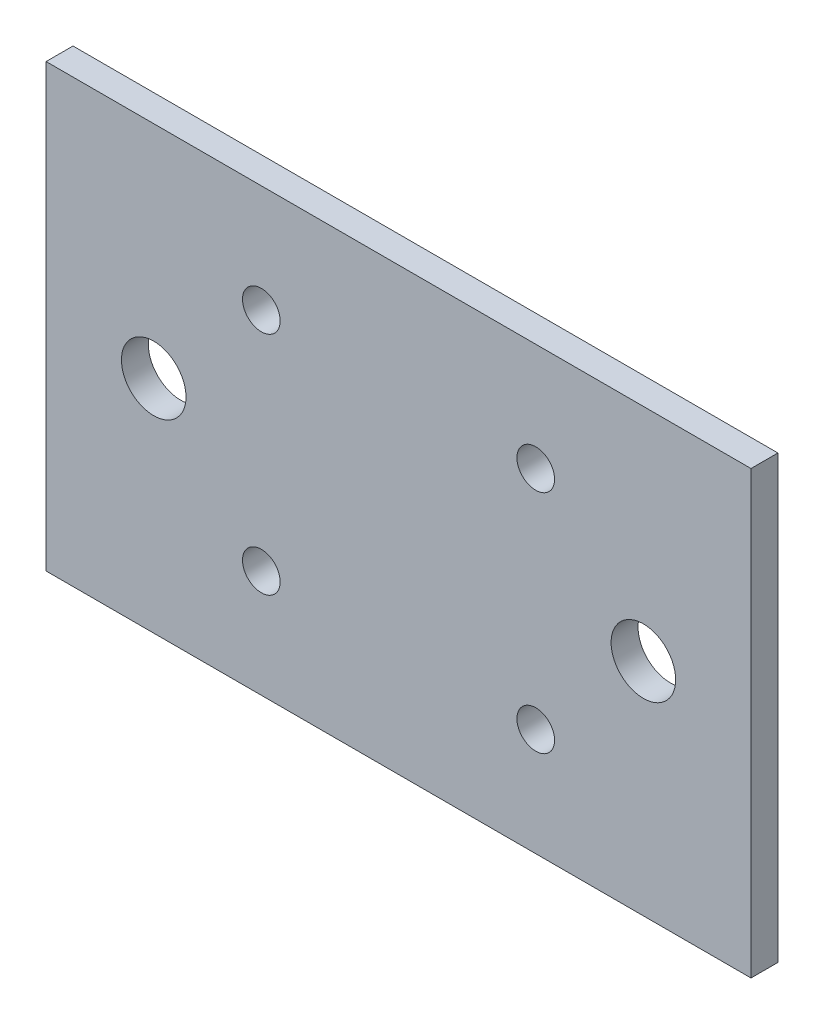
ISO-10303-21;
HEADER;
FILE_DESCRIPTION(('STEP AP214'),'2;1');
FILE_NAME('part.step','',(''),(''),'','','');
FILE_SCHEMA(('AUTOMOTIVE_DESIGN { 1 0 10303 214 1 1 1 1 }'));
ENDSEC;
DATA;
#1=APPLICATION_CONTEXT('core data for automotive mechanical design processes');
#2=APPLICATION_PROTOCOL_DEFINITION('international standard','automotive_design',2000,#1);
#3=PRODUCT_CONTEXT('',#1,'mechanical');
#4=PRODUCT('Part','Part','',(#3));
#5=PRODUCT_RELATED_PRODUCT_CATEGORY('part','',(#4));
#6=PRODUCT_DEFINITION_FORMATION('','',#4);
#7=PRODUCT_DEFINITION_CONTEXT('part definition',#1,'design');
#8=PRODUCT_DEFINITION('design','',#6,#7);
#9=PRODUCT_DEFINITION_SHAPE('','',#8);
#10=(LENGTH_UNIT() NAMED_UNIT(*) SI_UNIT(.MILLI.,.METRE.));
#11=(NAMED_UNIT(*) PLANE_ANGLE_UNIT() SI_UNIT($,.RADIAN.));
#12=(NAMED_UNIT(*) SI_UNIT($,.STERADIAN.) SOLID_ANGLE_UNIT());
#13=UNCERTAINTY_MEASURE_WITH_UNIT(LENGTH_MEASURE(1.E-05),#10,'distance_accuracy_value','');
#14=(GEOMETRIC_REPRESENTATION_CONTEXT(3) GLOBAL_UNCERTAINTY_ASSIGNED_CONTEXT((#13)) GLOBAL_UNIT_ASSIGNED_CONTEXT((#10,
#11,#12)) REPRESENTATION_CONTEXT('',''));
#15=CARTESIAN_POINT('',(0.,0.,0.));
#16=DIRECTION('',(0.,0.,1.));
#17=DIRECTION('',(1.,0.,0.));
#18=AXIS2_PLACEMENT_3D('',#15,#16,#17);
#19=CARTESIAN_POINT('',(0.,0.,2.5));
#20=DIRECTION('',(0.,0.,1.));
#21=DIRECTION('',(1.,0.,0.));
#22=AXIS2_PLACEMENT_3D('',#19,#20,#21);
#23=PLANE('',#22);
#24=CARTESIAN_POINT('',(12.75,-10.5,2.5));
#25=DIRECTION('',(0.,0.,1.));
#26=DIRECTION('',(1.,0.,0.));
#27=AXIS2_PLACEMENT_3D('',#24,#25,#26);
#28=CIRCLE('',#27,1.75);
#29=CARTESIAN_POINT('',(14.5,-10.5,2.5));
#30=VERTEX_POINT('',#29);
#31=EDGE_CURVE('E133',#30,#30,#28,.T.);
#32=ORIENTED_EDGE('',*,*,#31,.F.);
#33=EDGE_LOOP('',(#32));
#34=FACE_BOUND('',#33,.T.);
#35=CARTESIAN_POINT('',(-12.75,10.5,2.5));
#36=DIRECTION('',(0.,0.,1.));
#37=DIRECTION('',(1.,0.,0.));
#38=AXIS2_PLACEMENT_3D('',#35,#36,#37);
#39=CIRCLE('',#38,1.75);
#40=CARTESIAN_POINT('',(-11.,10.5,2.5));
#41=VERTEX_POINT('',#40);
#42=EDGE_CURVE('E121',#41,#41,#39,.T.);
#43=ORIENTED_EDGE('',*,*,#42,.F.);
#44=EDGE_LOOP('',(#43));
#45=FACE_BOUND('',#44,.T.);
#46=CARTESIAN_POINT('',(-22.75,0.,2.5));
#47=DIRECTION('',(0.,0.,1.));
#48=DIRECTION('',(1.,0.,0.));
#49=AXIS2_PLACEMENT_3D('',#46,#47,#48);
#50=CIRCLE('',#49,3.00000000000001);
#51=CARTESIAN_POINT('',(-19.75,0.,2.5));
#52=VERTEX_POINT('',#51);
#53=EDGE_CURVE('E100',#52,#52,#50,.T.);
#54=ORIENTED_EDGE('',*,*,#53,.F.);
#55=EDGE_LOOP('',(#54));
#56=FACE_BOUND('',#55,.T.);
#57=DIRECTION('',(0.,1.,0.));
#58=VECTOR('',#57,1.);
#59=CARTESIAN_POINT('',(32.75,20.5,2.5));
#60=LINE('',#59,#58);
#61=CARTESIAN_POINT('',(32.75,-20.5,2.5));
#62=VERTEX_POINT('',#61);
#63=CARTESIAN_POINT('',(32.75,20.5,2.5));
#64=VERTEX_POINT('',#63);
#65=EDGE_CURVE('E85',#62,#64,#60,.T.);
#66=ORIENTED_EDGE('',*,*,#65,.T.);
#67=DIRECTION('',(-1.,0.,0.));
#68=VECTOR('',#67,1.);
#69=CARTESIAN_POINT('',(-32.75,20.5,2.5));
#70=LINE('',#69,#68);
#71=CARTESIAN_POINT('',(-32.75,20.5,2.5));
#72=VERTEX_POINT('',#71);
#73=EDGE_CURVE('E80',#64,#72,#70,.T.);
#74=ORIENTED_EDGE('',*,*,#73,.T.);
#75=DIRECTION('',(0.,-1.,0.));
#76=VECTOR('',#75,1.);
#77=CARTESIAN_POINT('',(-32.75,20.5,2.5));
#78=LINE('',#77,#76);
#79=CARTESIAN_POINT('',(-32.75,-20.5,2.5));
#80=VERTEX_POINT('',#79);
#81=EDGE_CURVE('E83',#72,#80,#78,.T.);
#82=ORIENTED_EDGE('',*,*,#81,.T.);
#83=DIRECTION('',(1.,0.,0.));
#84=VECTOR('',#83,1.);
#85=CARTESIAN_POINT('',(-32.75,-20.5,2.5));
#86=LINE('',#85,#84);
#87=EDGE_CURVE('E50',#80,#62,#86,.T.);
#88=ORIENTED_EDGE('',*,*,#87,.T.);
#89=EDGE_LOOP('',(#66,#74,#82,#88));
#90=FACE_BOUND('',#89,.T.);
#91=CARTESIAN_POINT('',(22.75,0.,2.5));
#92=DIRECTION('',(0.,0.,1.));
#93=DIRECTION('',(1.,0.,0.));
#94=AXIS2_PLACEMENT_3D('',#91,#92,#93);
#95=CIRCLE('',#94,3.00000000000001);
#96=CARTESIAN_POINT('',(25.75,0.,2.5));
#97=VERTEX_POINT('',#96);
#98=EDGE_CURVE('E115',#97,#97,#95,.T.);
#99=ORIENTED_EDGE('',*,*,#98,.F.);
#100=EDGE_LOOP('',(#99));
#101=FACE_BOUND('',#100,.T.);
#102=CARTESIAN_POINT('',(12.75,10.5,2.5));
#103=DIRECTION('',(0.,0.,1.));
#104=DIRECTION('',(1.,0.,0.));
#105=AXIS2_PLACEMENT_3D('',#102,#103,#104);
#106=CIRCLE('',#105,1.75);
#107=CARTESIAN_POINT('',(14.5,10.5,2.5));
#108=VERTEX_POINT('',#107);
#109=EDGE_CURVE('E127',#108,#108,#106,.T.);
#110=ORIENTED_EDGE('',*,*,#109,.F.);
#111=EDGE_LOOP('',(#110));
#112=FACE_BOUND('',#111,.T.);
#113=CARTESIAN_POINT('',(-12.75,-10.5,2.5));
#114=DIRECTION('',(0.,0.,1.));
#115=DIRECTION('',(1.,0.,0.));
#116=AXIS2_PLACEMENT_3D('',#113,#114,#115);
#117=CIRCLE('',#116,1.75);
#118=CARTESIAN_POINT('',(-11.,-10.5,2.5));
#119=VERTEX_POINT('',#118);
#120=EDGE_CURVE('E139',#119,#119,#117,.T.);
#121=ORIENTED_EDGE('',*,*,#120,.F.);
#122=EDGE_LOOP('',(#121));
#123=FACE_BOUND('',#122,.T.);
#124=ADVANCED_FACE('F33',(#34,#45,#56,#90,#101,#112,#123),#23,.T.);
#125=CARTESIAN_POINT('',(0.,0.,0.));
#126=DIRECTION('',(0.,0.,1.));
#127=DIRECTION('',(1.,0.,0.));
#128=AXIS2_PLACEMENT_3D('',#125,#126,#127);
#129=PLANE('',#128);
#130=DIRECTION('',(0.,1.,0.));
#131=VECTOR('',#130,1.);
#132=CARTESIAN_POINT('',(32.75,20.5,0.));
#133=LINE('',#132,#131);
#134=CARTESIAN_POINT('',(32.75,-20.5,0.));
#135=VERTEX_POINT('',#134);
#136=CARTESIAN_POINT('',(32.75,20.5,0.));
#137=VERTEX_POINT('',#136);
#138=EDGE_CURVE('E97',#135,#137,#133,.T.);
#139=ORIENTED_EDGE('',*,*,#138,.F.);
#140=DIRECTION('',(1.,0.,0.));
#141=VECTOR('',#140,1.);
#142=CARTESIAN_POINT('',(-32.75,-20.5,0.));
#143=LINE('',#142,#141);
#144=CARTESIAN_POINT('',(-32.75,-20.5,0.));
#145=VERTEX_POINT('',#144);
#146=EDGE_CURVE('E73',#145,#135,#143,.T.);
#147=ORIENTED_EDGE('',*,*,#146,.F.);
#148=DIRECTION('',(0.,-1.,0.));
#149=VECTOR('',#148,1.);
#150=CARTESIAN_POINT('',(-32.75,20.5,0.));
#151=LINE('',#150,#149);
#152=CARTESIAN_POINT('',(-32.75,20.5,0.));
#153=VERTEX_POINT('',#152);
#154=EDGE_CURVE('E67',#153,#145,#151,.T.);
#155=ORIENTED_EDGE('',*,*,#154,.F.);
#156=DIRECTION('',(-1.,0.,0.));
#157=VECTOR('',#156,1.);
#158=CARTESIAN_POINT('',(-32.75,20.5,0.));
#159=LINE('',#158,#157);
#160=EDGE_CURVE('E89',#137,#153,#159,.T.);
#161=ORIENTED_EDGE('',*,*,#160,.F.);
#162=EDGE_LOOP('',(#139,#147,#155,#161));
#163=FACE_BOUND('',#162,.T.);
#164=CARTESIAN_POINT('',(-22.75,0.,0.));
#165=DIRECTION('',(0.,0.,1.));
#166=DIRECTION('',(1.,0.,0.));
#167=AXIS2_PLACEMENT_3D('',#164,#165,#166);
#168=CIRCLE('',#167,3.00000000000001);
#169=CARTESIAN_POINT('',(-19.75,0.,0.));
#170=VERTEX_POINT('',#169);
#171=EDGE_CURVE('E112',#170,#170,#168,.T.);
#172=ORIENTED_EDGE('',*,*,#171,.T.);
#173=EDGE_LOOP('',(#172));
#174=FACE_BOUND('',#173,.T.);
#175=CARTESIAN_POINT('',(22.75,0.,0.));
#176=DIRECTION('',(0.,0.,1.));
#177=DIRECTION('',(1.,0.,0.));
#178=AXIS2_PLACEMENT_3D('',#175,#176,#177);
#179=CIRCLE('',#178,3.00000000000001);
#180=CARTESIAN_POINT('',(25.75,0.,0.));
#181=VERTEX_POINT('',#180);
#182=EDGE_CURVE('E118',#181,#181,#179,.T.);
#183=ORIENTED_EDGE('',*,*,#182,.T.);
#184=EDGE_LOOP('',(#183));
#185=FACE_BOUND('',#184,.T.);
#186=CARTESIAN_POINT('',(-12.75,10.5,0.));
#187=DIRECTION('',(0.,0.,1.));
#188=DIRECTION('',(1.,0.,0.));
#189=AXIS2_PLACEMENT_3D('',#186,#187,#188);
#190=CIRCLE('',#189,1.75);
#191=CARTESIAN_POINT('',(-11.,10.5,0.));
#192=VERTEX_POINT('',#191);
#193=EDGE_CURVE('E124',#192,#192,#190,.T.);
#194=ORIENTED_EDGE('',*,*,#193,.T.);
#195=EDGE_LOOP('',(#194));
#196=FACE_BOUND('',#195,.T.);
#197=CARTESIAN_POINT('',(12.75,10.5,0.));
#198=DIRECTION('',(0.,0.,1.));
#199=DIRECTION('',(1.,0.,0.));
#200=AXIS2_PLACEMENT_3D('',#197,#198,#199);
#201=CIRCLE('',#200,1.75);
#202=CARTESIAN_POINT('',(14.5,10.5,0.));
#203=VERTEX_POINT('',#202);
#204=EDGE_CURVE('E130',#203,#203,#201,.T.);
#205=ORIENTED_EDGE('',*,*,#204,.T.);
#206=EDGE_LOOP('',(#205));
#207=FACE_BOUND('',#206,.T.);
#208=CARTESIAN_POINT('',(12.75,-10.5,0.));
#209=DIRECTION('',(0.,0.,1.));
#210=DIRECTION('',(1.,0.,0.));
#211=AXIS2_PLACEMENT_3D('',#208,#209,#210);
#212=CIRCLE('',#211,1.75);
#213=CARTESIAN_POINT('',(14.5,-10.5,0.));
#214=VERTEX_POINT('',#213);
#215=EDGE_CURVE('E136',#214,#214,#212,.T.);
#216=ORIENTED_EDGE('',*,*,#215,.T.);
#217=EDGE_LOOP('',(#216));
#218=FACE_BOUND('',#217,.T.);
#219=CARTESIAN_POINT('',(-12.75,-10.5,0.));
#220=DIRECTION('',(0.,0.,1.));
#221=DIRECTION('',(1.,0.,0.));
#222=AXIS2_PLACEMENT_3D('',#219,#220,#221);
#223=CIRCLE('',#222,1.75);
#224=CARTESIAN_POINT('',(-11.,-10.5,0.));
#225=VERTEX_POINT('',#224);
#226=EDGE_CURVE('E142',#225,#225,#223,.T.);
#227=ORIENTED_EDGE('',*,*,#226,.T.);
#228=EDGE_LOOP('',(#227));
#229=FACE_BOUND('',#228,.T.);
#230=ADVANCED_FACE('F108',(#163,#174,#185,#196,#207,#218,#229),#129,.F.);
#231=CARTESIAN_POINT('',(32.75,20.5,2.5));
#232=DIRECTION('',(-1.,0.,0.));
#233=DIRECTION('',(0.,-1.,0.));
#234=AXIS2_PLACEMENT_3D('',#231,#232,#233);
#235=PLANE('',#234);
#236=ORIENTED_EDGE('',*,*,#138,.T.);
#237=DIRECTION('',(0.,0.,-1.));
#238=VECTOR('',#237,1.);
#239=CARTESIAN_POINT('',(32.75,20.5,2.5));
#240=LINE('',#239,#238);
#241=EDGE_CURVE('E11',#64,#137,#240,.T.);
#242=ORIENTED_EDGE('',*,*,#241,.F.);
#243=ORIENTED_EDGE('',*,*,#65,.F.);
#244=DIRECTION('',(0.,0.,-1.));
#245=VECTOR('',#244,1.);
#246=CARTESIAN_POINT('',(32.75,-20.5,2.5));
#247=LINE('',#246,#245);
#248=EDGE_CURVE('E93',#62,#135,#247,.T.);
#249=ORIENTED_EDGE('',*,*,#248,.T.);
#250=EDGE_LOOP('',(#236,#242,#243,#249));
#251=FACE_BOUND('',#250,.T.);
#252=ADVANCED_FACE('F35',(#251),#235,.F.);
#253=CARTESIAN_POINT('',(-32.75,20.5,2.5));
#254=DIRECTION('',(0.,-1.,0.));
#255=DIRECTION('',(0.,0.,-1.));
#256=AXIS2_PLACEMENT_3D('',#253,#254,#255);
#257=PLANE('',#256);
#258=ORIENTED_EDGE('',*,*,#160,.T.);
#259=DIRECTION('',(0.,0.,-1.));
#260=VECTOR('',#259,1.);
#261=CARTESIAN_POINT('',(-32.75,20.5,2.5));
#262=LINE('',#261,#260);
#263=EDGE_CURVE('E42',#72,#153,#262,.T.);
#264=ORIENTED_EDGE('',*,*,#263,.F.);
#265=ORIENTED_EDGE('',*,*,#73,.F.);
#266=ORIENTED_EDGE('',*,*,#241,.T.);
#267=EDGE_LOOP('',(#258,#264,#265,#266));
#268=FACE_BOUND('',#267,.T.);
#269=ADVANCED_FACE('F88',(#268),#257,.F.);
#270=CARTESIAN_POINT('',(-32.75,20.5,2.5));
#271=DIRECTION('',(1.,0.,0.));
#272=DIRECTION('',(0.,0.,-1.));
#273=AXIS2_PLACEMENT_3D('',#270,#271,#272);
#274=PLANE('',#273);
#275=ORIENTED_EDGE('',*,*,#154,.T.);
#276=DIRECTION('',(0.,0.,-1.));
#277=VECTOR('',#276,1.);
#278=CARTESIAN_POINT('',(-32.75,-20.5,2.5));
#279=LINE('',#278,#277);
#280=EDGE_CURVE('E90',#80,#145,#279,.T.);
#281=ORIENTED_EDGE('',*,*,#280,.F.);
#282=ORIENTED_EDGE('',*,*,#81,.F.);
#283=ORIENTED_EDGE('',*,*,#263,.T.);
#284=EDGE_LOOP('',(#275,#281,#282,#283));
#285=FACE_BOUND('',#284,.T.);
#286=ADVANCED_FACE('F91',(#285),#274,.F.);
#287=CARTESIAN_POINT('',(-32.75,-20.5,2.5));
#288=DIRECTION('',(0.,1.,0.));
#289=DIRECTION('',(0.,0.,1.));
#290=AXIS2_PLACEMENT_3D('',#287,#288,#289);
#291=PLANE('',#290);
#292=ORIENTED_EDGE('',*,*,#146,.T.);
#293=ORIENTED_EDGE('',*,*,#248,.F.);
#294=ORIENTED_EDGE('',*,*,#87,.F.);
#295=ORIENTED_EDGE('',*,*,#280,.T.);
#296=EDGE_LOOP('',(#292,#293,#294,#295));
#297=FACE_BOUND('',#296,.T.);
#298=ADVANCED_FACE('F105',(#297),#291,.F.);
#299=CARTESIAN_POINT('',(-22.75,0.,2.5));
#300=DIRECTION('',(0.,0.,-1.));
#301=DIRECTION('',(-1.,0.,0.));
#302=AXIS2_PLACEMENT_3D('',#299,#300,#301);
#303=CYLINDRICAL_SURFACE('',#302,3.00000000000001);
#304=ORIENTED_EDGE('',*,*,#53,.T.);
#305=EDGE_LOOP('',(#304));
#306=FACE_BOUND('',#305,.T.);
#307=ORIENTED_EDGE('',*,*,#171,.F.);
#308=EDGE_LOOP('',(#307));
#309=FACE_BOUND('',#308,.T.);
#310=ADVANCED_FACE('F161',(#306,#309),#303,.F.);
#311=CARTESIAN_POINT('',(22.75,0.,2.5));
#312=DIRECTION('',(0.,0.,-1.));
#313=DIRECTION('',(-1.,0.,0.));
#314=AXIS2_PLACEMENT_3D('',#311,#312,#313);
#315=CYLINDRICAL_SURFACE('',#314,3.00000000000001);
#316=ORIENTED_EDGE('',*,*,#98,.T.);
#317=EDGE_LOOP('',(#316));
#318=FACE_BOUND('',#317,.T.);
#319=ORIENTED_EDGE('',*,*,#182,.F.);
#320=EDGE_LOOP('',(#319));
#321=FACE_BOUND('',#320,.T.);
#322=ADVANCED_FACE('F207',(#318,#321),#315,.F.);
#323=CARTESIAN_POINT('',(-12.75,10.5,2.5));
#324=DIRECTION('',(0.,0.,-1.));
#325=DIRECTION('',(-1.,0.,0.));
#326=AXIS2_PLACEMENT_3D('',#323,#324,#325);
#327=CYLINDRICAL_SURFACE('',#326,1.75);
#328=ORIENTED_EDGE('',*,*,#42,.T.);
#329=EDGE_LOOP('',(#328));
#330=FACE_BOUND('',#329,.T.);
#331=ORIENTED_EDGE('',*,*,#193,.F.);
#332=EDGE_LOOP('',(#331));
#333=FACE_BOUND('',#332,.T.);
#334=ADVANCED_FACE('F215',(#330,#333),#327,.F.);
#335=CARTESIAN_POINT('',(12.75,10.5,2.5));
#336=DIRECTION('',(0.,0.,-1.));
#337=DIRECTION('',(-1.,0.,0.));
#338=AXIS2_PLACEMENT_3D('',#335,#336,#337);
#339=CYLINDRICAL_SURFACE('',#338,1.75);
#340=ORIENTED_EDGE('',*,*,#109,.T.);
#341=EDGE_LOOP('',(#340));
#342=FACE_BOUND('',#341,.T.);
#343=ORIENTED_EDGE('',*,*,#204,.F.);
#344=EDGE_LOOP('',(#343));
#345=FACE_BOUND('',#344,.T.);
#346=ADVANCED_FACE('F223',(#342,#345),#339,.F.);
#347=CARTESIAN_POINT('',(12.75,-10.5,2.5));
#348=DIRECTION('',(0.,0.,-1.));
#349=DIRECTION('',(-1.,0.,0.));
#350=AXIS2_PLACEMENT_3D('',#347,#348,#349);
#351=CYLINDRICAL_SURFACE('',#350,1.75);
#352=ORIENTED_EDGE('',*,*,#31,.T.);
#353=EDGE_LOOP('',(#352));
#354=FACE_BOUND('',#353,.T.);
#355=ORIENTED_EDGE('',*,*,#215,.F.);
#356=EDGE_LOOP('',(#355));
#357=FACE_BOUND('',#356,.T.);
#358=ADVANCED_FACE('F232',(#354,#357),#351,.F.);
#359=CARTESIAN_POINT('',(-12.75,-10.5,2.5));
#360=DIRECTION('',(0.,0.,-1.));
#361=DIRECTION('',(-1.,0.,0.));
#362=AXIS2_PLACEMENT_3D('',#359,#360,#361);
#363=CYLINDRICAL_SURFACE('',#362,1.75);
#364=ORIENTED_EDGE('',*,*,#120,.T.);
#365=EDGE_LOOP('',(#364));
#366=FACE_BOUND('',#365,.T.);
#367=ORIENTED_EDGE('',*,*,#226,.F.);
#368=EDGE_LOOP('',(#367));
#369=FACE_BOUND('',#368,.T.);
#370=ADVANCED_FACE('F148',(#366,#369),#363,.F.);
#371=CLOSED_SHELL('',(#124,#230,#252,#269,#286,#298,#310,#322,#334,#346,#358,#370));
#372=MANIFOLD_SOLID_BREP('B2',#371);
#373=ADVANCED_BREP_SHAPE_REPRESENTATION('',(#18,#372),#14);
#374=SHAPE_DEFINITION_REPRESENTATION(#9,#373);
ENDSEC;
END-ISO-10303-21;
